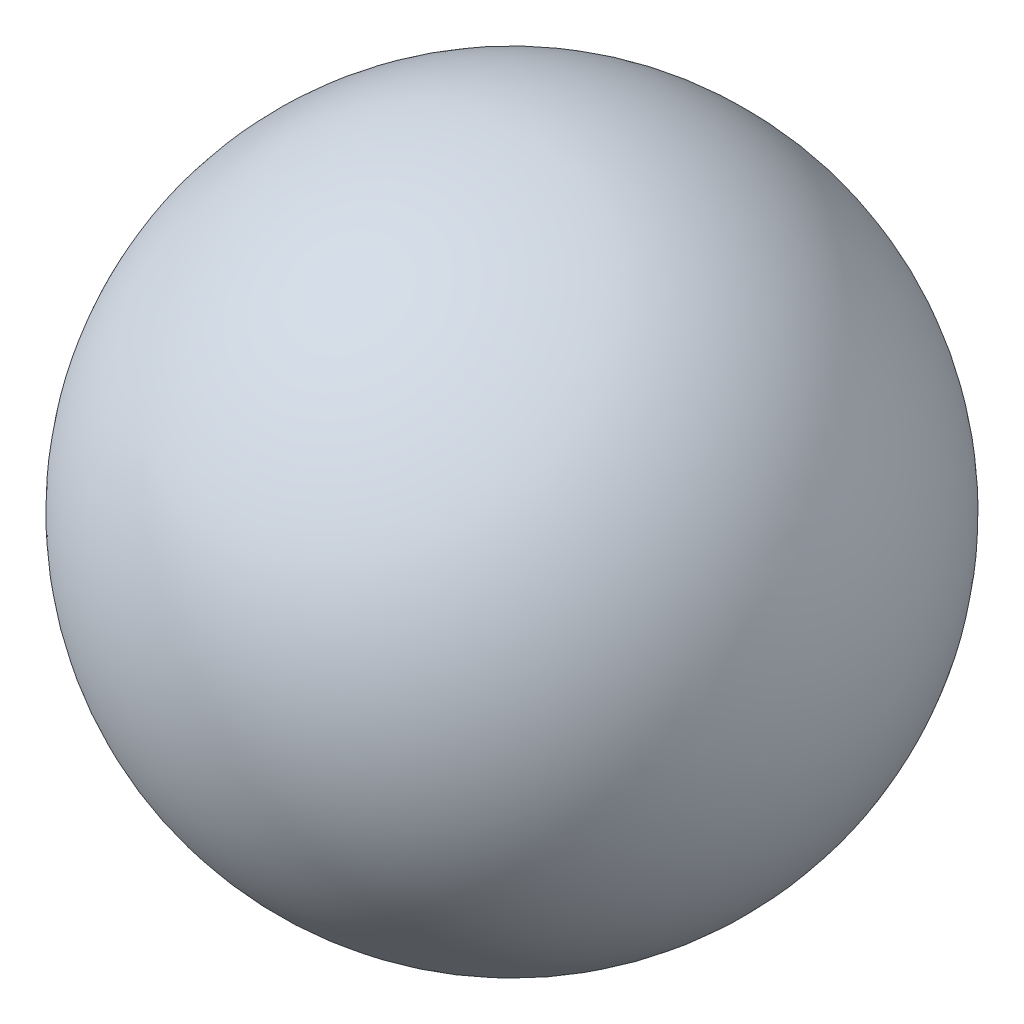
ISO-10303-21;
HEADER;
FILE_DESCRIPTION(('STEP AP214'),'2;1');
FILE_NAME('part.step','',(''),(''),'','','');
FILE_SCHEMA(('AUTOMOTIVE_DESIGN { 1 0 10303 214 1 1 1 1 }'));
ENDSEC;
DATA;
#1=APPLICATION_CONTEXT('core data for automotive mechanical design processes');
#2=APPLICATION_PROTOCOL_DEFINITION('international standard','automotive_design',2000,#1);
#3=PRODUCT_CONTEXT('',#1,'mechanical');
#4=PRODUCT('Part','Part','',(#3));
#5=PRODUCT_RELATED_PRODUCT_CATEGORY('part','',(#4));
#6=PRODUCT_DEFINITION_FORMATION('','',#4);
#7=PRODUCT_DEFINITION_CONTEXT('part definition',#1,'design');
#8=PRODUCT_DEFINITION('design','',#6,#7);
#9=PRODUCT_DEFINITION_SHAPE('','',#8);
#10=(LENGTH_UNIT() NAMED_UNIT(*) SI_UNIT(.MILLI.,.METRE.));
#11=(NAMED_UNIT(*) PLANE_ANGLE_UNIT() SI_UNIT($,.RADIAN.));
#12=(NAMED_UNIT(*) SI_UNIT($,.STERADIAN.) SOLID_ANGLE_UNIT());
#13=UNCERTAINTY_MEASURE_WITH_UNIT(LENGTH_MEASURE(1.E-05),#10,'distance_accuracy_value','');
#14=(GEOMETRIC_REPRESENTATION_CONTEXT(3) GLOBAL_UNCERTAINTY_ASSIGNED_CONTEXT((#13)) GLOBAL_UNIT_ASSIGNED_CONTEXT((#10,
#11,#12)) REPRESENTATION_CONTEXT('',''));
#15=CARTESIAN_POINT('',(0.,0.,0.));
#16=DIRECTION('',(0.,0.,1.));
#17=DIRECTION('',(1.,0.,0.));
#18=AXIS2_PLACEMENT_3D('',#15,#16,#17);
#19=CARTESIAN_POINT('',(0.,0.,0.));
#20=DIRECTION('',(-1.,0.,0.));
#21=DIRECTION('',(0.,1.,0.));
#22=AXIS2_PLACEMENT_3D('',#19,#20,#21);
#23=SPHERICAL_SURFACE('',#22,76.2);
#24=CARTESIAN_POINT('',(-76.2,0.,0.));
#25=VERTEX_POINT('',#24);
#26=VERTEX_LOOP('',#25);
#27=FACE_BOUND('',#26,.T.);
#28=ADVANCED_FACE('F33',(#27),#23,.T.);
#29=CLOSED_SHELL('',(#28));
#30=MANIFOLD_SOLID_BREP('B2',#29);
#31=ADVANCED_BREP_SHAPE_REPRESENTATION('',(#18,#30),#14);
#32=SHAPE_DEFINITION_REPRESENTATION(#9,#31);
ENDSEC;
END-ISO-10303-21;
